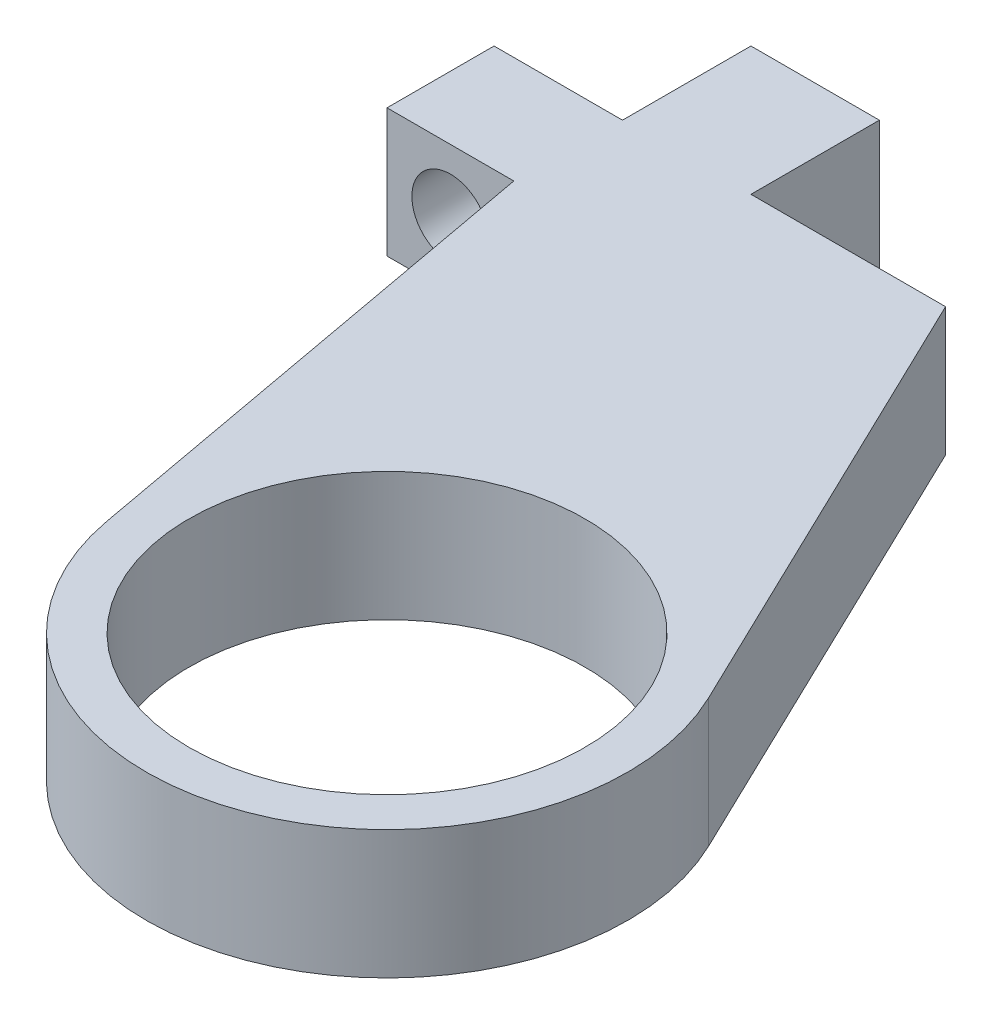
ISO-10303-21;
HEADER;
FILE_DESCRIPTION(('STEP AP214'),'2;1');
FILE_NAME('part.step','',(''),(''),'','','');
FILE_SCHEMA(('AUTOMOTIVE_DESIGN { 1 0 10303 214 1 1 1 1 }'));
ENDSEC;
DATA;
#1=APPLICATION_CONTEXT('core data for automotive mechanical design processes');
#2=APPLICATION_PROTOCOL_DEFINITION('international standard','automotive_design',2000,#1);
#3=PRODUCT_CONTEXT('',#1,'mechanical');
#4=PRODUCT('Part','Part','',(#3));
#5=PRODUCT_RELATED_PRODUCT_CATEGORY('part','',(#4));
#6=PRODUCT_DEFINITION_FORMATION('','',#4);
#7=PRODUCT_DEFINITION_CONTEXT('part definition',#1,'design');
#8=PRODUCT_DEFINITION('design','',#6,#7);
#9=PRODUCT_DEFINITION_SHAPE('','',#8);
#10=(LENGTH_UNIT() NAMED_UNIT(*) SI_UNIT(.MILLI.,.METRE.));
#11=(NAMED_UNIT(*) PLANE_ANGLE_UNIT() SI_UNIT($,.RADIAN.));
#12=(NAMED_UNIT(*) SI_UNIT($,.STERADIAN.) SOLID_ANGLE_UNIT());
#13=UNCERTAINTY_MEASURE_WITH_UNIT(LENGTH_MEASURE(1.E-05),#10,'distance_accuracy_value','');
#14=(GEOMETRIC_REPRESENTATION_CONTEXT(3) GLOBAL_UNCERTAINTY_ASSIGNED_CONTEXT((#13)) GLOBAL_UNIT_ASSIGNED_CONTEXT((#10,
#11,#12)) REPRESENTATION_CONTEXT('',''));
#15=CARTESIAN_POINT('',(0.,0.,0.));
#16=DIRECTION('',(0.,0.,1.));
#17=DIRECTION('',(1.,0.,0.));
#18=AXIS2_PLACEMENT_3D('',#15,#16,#17);
#19=CARTESIAN_POINT('',(0.,6.,0.));
#20=DIRECTION('',(0.,1.,0.));
#21=DIRECTION('',(0.,0.,1.));
#22=AXIS2_PLACEMENT_3D('',#19,#20,#21);
#23=PLANE('',#22);
#24=DIRECTION('',(0.,0.,1.));
#25=VECTOR('',#24,1.);
#26=CARTESIAN_POINT('',(-21.25,6.,-26.25));
#27=LINE('',#26,#25);
#28=CARTESIAN_POINT('',(-21.25,6.,-26.25));
#29=VERTEX_POINT('',#28);
#30=CARTESIAN_POINT('',(-21.25,6.,-21.25));
#31=VERTEX_POINT('',#30);
#32=EDGE_CURVE('E162',#29,#31,#27,.T.);
#33=ORIENTED_EDGE('',*,*,#32,.T.);
#34=DIRECTION('',(1.,0.,0.));
#35=VECTOR('',#34,1.);
#36=CARTESIAN_POINT('',(-21.25,6.,-21.25));
#37=LINE('',#36,#35);
#38=CARTESIAN_POINT('',(-15.3275514760327,6.,-21.25));
#39=VERTEX_POINT('',#38);
#40=EDGE_CURVE('E100',#31,#39,#37,.T.);
#41=ORIENTED_EDGE('',*,*,#40,.T.);
#42=DIRECTION('',(0.180091480212623,0.,0.983649865935449));
#43=VECTOR('',#42,1.);
#44=CARTESIAN_POINT('',(-15.3275514760327,6.,-21.25));
#45=LINE('',#44,#43);
#46=CARTESIAN_POINT('',(-11.0660609917738,6.,2.02602915239201));
#47=VERTEX_POINT('',#46);
#48=EDGE_CURVE('E184',#39,#47,#45,.T.);
#49=ORIENTED_EDGE('',*,*,#48,.T.);
#50=CARTESIAN_POINT('',(0.,6.,0.));
#51=DIRECTION('',(0.,1.,0.));
#52=DIRECTION('',(0.,0.,1.));
#53=AXIS2_PLACEMENT_3D('',#50,#51,#52);
#54=CIRCLE('',#53,11.25);
#55=CARTESIAN_POINT('',(10.1351639217093,6.,-4.88271976259967));
#56=VERTEX_POINT('',#55);
#57=EDGE_CURVE('E203',#47,#56,#54,.T.);
#58=ORIENTED_EDGE('',*,*,#57,.T.);
#59=DIRECTION('',(-0.434019534453304,0.,-0.900903459707497));
#60=VECTOR('',#59,1.);
#61=CARTESIAN_POINT('',(-0.158743734257236,6.,-26.25));
#62=LINE('',#61,#60);
#63=CARTESIAN_POINT('',(-0.158743734257236,6.,-26.25));
#64=VERTEX_POINT('',#63);
#65=EDGE_CURVE('E200',#56,#64,#62,.T.);
#66=ORIENTED_EDGE('',*,*,#65,.T.);
#67=DIRECTION('',(-1.,0.,0.));
#68=VECTOR('',#67,1.);
#69=CARTESIAN_POINT('',(-9.25000000000001,6.,-26.25));
#70=LINE('',#69,#68);
#71=CARTESIAN_POINT('',(-9.25000000000001,6.,-26.25));
#72=VERTEX_POINT('',#71);
#73=EDGE_CURVE('E202',#64,#72,#70,.T.);
#74=ORIENTED_EDGE('',*,*,#73,.T.);
#75=DIRECTION('',(0.,0.,-1.));
#76=VECTOR('',#75,1.);
#77=CARTESIAN_POINT('',(-9.25,6.,-32.25));
#78=LINE('',#77,#76);
#79=CARTESIAN_POINT('',(-9.25,6.,-32.25));
#80=VERTEX_POINT('',#79);
#81=EDGE_CURVE('E125',#72,#80,#78,.T.);
#82=ORIENTED_EDGE('',*,*,#81,.T.);
#83=DIRECTION('',(-1.,0.,0.));
#84=VECTOR('',#83,1.);
#85=CARTESIAN_POINT('',(-15.25,6.,-32.25));
#86=LINE('',#85,#84);
#87=CARTESIAN_POINT('',(-15.25,6.,-32.25));
#88=VERTEX_POINT('',#87);
#89=EDGE_CURVE('E119',#80,#88,#86,.T.);
#90=ORIENTED_EDGE('',*,*,#89,.T.);
#91=DIRECTION('',(0.,0.,1.));
#92=VECTOR('',#91,1.);
#93=CARTESIAN_POINT('',(-15.25,6.,-26.25));
#94=LINE('',#93,#92);
#95=CARTESIAN_POINT('',(-15.25,6.,-26.25));
#96=VERTEX_POINT('',#95);
#97=EDGE_CURVE('E123',#88,#96,#94,.T.);
#98=ORIENTED_EDGE('',*,*,#97,.T.);
#99=DIRECTION('',(-1.,0.,0.));
#100=VECTOR('',#99,1.);
#101=CARTESIAN_POINT('',(-21.25,6.,-26.25));
#102=LINE('',#101,#100);
#103=EDGE_CURVE('E51',#96,#29,#102,.T.);
#104=ORIENTED_EDGE('',*,*,#103,.T.);
#105=EDGE_LOOP('',(#33,#41,#49,#58,#66,#74,#82,#90,#98,#104));
#106=FACE_BOUND('',#105,.T.);
#107=CARTESIAN_POINT('',(0.,6.,0.));
#108=DIRECTION('',(0.,1.,0.));
#109=DIRECTION('',(0.,0.,1.));
#110=AXIS2_PLACEMENT_3D('',#107,#108,#109);
#111=CIRCLE('',#110,9.25);
#112=CARTESIAN_POINT('',(0.,6.,9.25));
#113=VERTEX_POINT('',#112);
#114=EDGE_CURVE('E147',#113,#113,#111,.T.);
#115=ORIENTED_EDGE('',*,*,#114,.F.);
#116=EDGE_LOOP('',(#115));
#117=FACE_BOUND('',#116,.T.);
#118=ADVANCED_FACE('F33',(#106,#117),#23,.T.);
#119=CARTESIAN_POINT('',(0.,0.,0.));
#120=DIRECTION('',(0.,1.,0.));
#121=DIRECTION('',(0.,0.,1.));
#122=AXIS2_PLACEMENT_3D('',#119,#120,#121);
#123=PLANE('',#122);
#124=DIRECTION('',(0.,0.,1.));
#125=VECTOR('',#124,1.);
#126=CARTESIAN_POINT('',(-21.25,0.,-26.25));
#127=LINE('',#126,#125);
#128=CARTESIAN_POINT('',(-21.25,0.,-26.25));
#129=VERTEX_POINT('',#128);
#130=CARTESIAN_POINT('',(-21.25,0.,-21.25));
#131=VERTEX_POINT('',#130);
#132=EDGE_CURVE('E143',#129,#131,#127,.T.);
#133=ORIENTED_EDGE('',*,*,#132,.F.);
#134=DIRECTION('',(-1.,0.,0.));
#135=VECTOR('',#134,1.);
#136=CARTESIAN_POINT('',(-21.25,0.,-26.25));
#137=LINE('',#136,#135);
#138=CARTESIAN_POINT('',(-15.25,0.,-26.25));
#139=VERTEX_POINT('',#138);
#140=EDGE_CURVE('E92',#139,#129,#137,.T.);
#141=ORIENTED_EDGE('',*,*,#140,.F.);
#142=DIRECTION('',(0.,0.,1.));
#143=VECTOR('',#142,1.);
#144=CARTESIAN_POINT('',(-15.25,0.,-26.25));
#145=LINE('',#144,#143);
#146=CARTESIAN_POINT('',(-15.25,0.,-32.25));
#147=VERTEX_POINT('',#146);
#148=EDGE_CURVE('E86',#147,#139,#145,.T.);
#149=ORIENTED_EDGE('',*,*,#148,.F.);
#150=DIRECTION('',(-1.,0.,0.));
#151=VECTOR('',#150,1.);
#152=CARTESIAN_POINT('',(-15.25,0.,-32.25));
#153=LINE('',#152,#151);
#154=CARTESIAN_POINT('',(-9.25,0.,-32.25));
#155=VERTEX_POINT('',#154);
#156=EDGE_CURVE('E133',#155,#147,#153,.T.);
#157=ORIENTED_EDGE('',*,*,#156,.F.);
#158=DIRECTION('',(0.,0.,-1.));
#159=VECTOR('',#158,1.);
#160=CARTESIAN_POINT('',(-9.25,0.,-32.25));
#161=LINE('',#160,#159);
#162=CARTESIAN_POINT('',(-9.25000000000001,0.,-26.25));
#163=VERTEX_POINT('',#162);
#164=EDGE_CURVE('E157',#163,#155,#161,.T.);
#165=ORIENTED_EDGE('',*,*,#164,.F.);
#166=DIRECTION('',(-1.,0.,0.));
#167=VECTOR('',#166,1.);
#168=CARTESIAN_POINT('',(-9.25000000000001,0.,-26.25));
#169=LINE('',#168,#167);
#170=CARTESIAN_POINT('',(-0.158743734257236,0.,-26.25));
#171=VERTEX_POINT('',#170);
#172=EDGE_CURVE('E155',#171,#163,#169,.T.);
#173=ORIENTED_EDGE('',*,*,#172,.F.);
#174=DIRECTION('',(-0.434019534453304,0.,-0.900903459707497));
#175=VECTOR('',#174,1.);
#176=CARTESIAN_POINT('',(-0.158743734257236,0.,-26.25));
#177=LINE('',#176,#175);
#178=CARTESIAN_POINT('',(10.1351639217093,0.,-4.88271976259967));
#179=VERTEX_POINT('',#178);
#180=EDGE_CURVE('E153',#179,#171,#177,.T.);
#181=ORIENTED_EDGE('',*,*,#180,.F.);
#182=CARTESIAN_POINT('',(0.,0.,0.));
#183=DIRECTION('',(0.,1.,0.));
#184=DIRECTION('',(0.,0.,1.));
#185=AXIS2_PLACEMENT_3D('',#182,#183,#184);
#186=CIRCLE('',#185,11.25);
#187=CARTESIAN_POINT('',(-11.0660609917738,0.,2.02602915239201));
#188=VERTEX_POINT('',#187);
#189=EDGE_CURVE('E151',#188,#179,#186,.T.);
#190=ORIENTED_EDGE('',*,*,#189,.F.);
#191=DIRECTION('',(0.180091480212623,0.,0.983649865935449));
#192=VECTOR('',#191,1.);
#193=CARTESIAN_POINT('',(-15.3275514760327,0.,-21.25));
#194=LINE('',#193,#192);
#195=CARTESIAN_POINT('',(-15.3275514760327,0.,-21.25));
#196=VERTEX_POINT('',#195);
#197=EDGE_CURVE('E149',#196,#188,#194,.T.);
#198=ORIENTED_EDGE('',*,*,#197,.F.);
#199=DIRECTION('',(1.,0.,0.));
#200=VECTOR('',#199,1.);
#201=CARTESIAN_POINT('',(-21.25,0.,-21.25));
#202=LINE('',#201,#200);
#203=EDGE_CURVE('E146',#131,#196,#202,.T.);
#204=ORIENTED_EDGE('',*,*,#203,.F.);
#205=EDGE_LOOP('',(#133,#141,#149,#157,#165,#173,#181,#190,#198,#204));
#206=FACE_BOUND('',#205,.T.);
#207=CARTESIAN_POINT('',(0.,0.,0.));
#208=DIRECTION('',(0.,1.,0.));
#209=DIRECTION('',(0.,0.,1.));
#210=AXIS2_PLACEMENT_3D('',#207,#208,#209);
#211=CIRCLE('',#210,9.25);
#212=CARTESIAN_POINT('',(0.,0.,9.25));
#213=VERTEX_POINT('',#212);
#214=EDGE_CURVE('E211',#213,#213,#211,.T.);
#215=ORIENTED_EDGE('',*,*,#214,.T.);
#216=EDGE_LOOP('',(#215));
#217=FACE_BOUND('',#216,.T.);
#218=ADVANCED_FACE('F188',(#206,#217),#123,.F.);
#219=CARTESIAN_POINT('',(-21.25,6.,-26.25));
#220=DIRECTION('',(1.,0.,0.));
#221=DIRECTION('',(0.,0.,-1.));
#222=AXIS2_PLACEMENT_3D('',#219,#220,#221);
#223=PLANE('',#222);
#224=ORIENTED_EDGE('',*,*,#132,.T.);
#225=DIRECTION('',(0.,-1.,0.));
#226=VECTOR('',#225,1.);
#227=CARTESIAN_POINT('',(-21.25,6.,-21.25));
#228=LINE('',#227,#226);
#229=EDGE_CURVE('E11',#31,#131,#228,.T.);
#230=ORIENTED_EDGE('',*,*,#229,.F.);
#231=ORIENTED_EDGE('',*,*,#32,.F.);
#232=DIRECTION('',(0.,-1.,0.));
#233=VECTOR('',#232,1.);
#234=CARTESIAN_POINT('',(-21.25,6.,-26.25));
#235=LINE('',#234,#233);
#236=EDGE_CURVE('E139',#29,#129,#235,.T.);
#237=ORIENTED_EDGE('',*,*,#236,.T.);
#238=EDGE_LOOP('',(#224,#230,#231,#237));
#239=FACE_BOUND('',#238,.T.);
#240=ADVANCED_FACE('F35',(#239),#223,.F.);
#241=CARTESIAN_POINT('',(-21.25,6.,-21.25));
#242=DIRECTION('',(0.,0.,-1.));
#243=DIRECTION('',(-1.,0.,0.));
#244=AXIS2_PLACEMENT_3D('',#241,#242,#243);
#245=PLANE('',#244);
#246=CARTESIAN_POINT('',(-18.2887757380163,3.,-21.25));
#247=DIRECTION('',(0.,0.,1.));
#248=DIRECTION('',(1.,0.,0.));
#249=AXIS2_PLACEMENT_3D('',#246,#247,#248);
#250=CIRCLE('',#249,1.8);
#251=CARTESIAN_POINT('',(-16.4887757380164,3.,-21.25));
#252=VERTEX_POINT('',#251);
#253=EDGE_CURVE('E216',#252,#252,#250,.T.);
#254=ORIENTED_EDGE('',*,*,#253,.F.);
#255=EDGE_LOOP('',(#254));
#256=FACE_BOUND('',#255,.T.);
#257=ORIENTED_EDGE('',*,*,#203,.T.);
#258=DIRECTION('',(0.,-1.,0.));
#259=VECTOR('',#258,1.);
#260=CARTESIAN_POINT('',(-15.3275514760327,6.,-21.25));
#261=LINE('',#260,#259);
#262=EDGE_CURVE('E43',#39,#196,#261,.T.);
#263=ORIENTED_EDGE('',*,*,#262,.F.);
#264=ORIENTED_EDGE('',*,*,#40,.F.);
#265=ORIENTED_EDGE('',*,*,#229,.T.);
#266=EDGE_LOOP('',(#257,#263,#264,#265));
#267=FACE_BOUND('',#266,.T.);
#268=ADVANCED_FACE('F260',(#256,#267),#245,.F.);
#269=CARTESIAN_POINT('',(-15.3275514760327,6.,-21.25));
#270=DIRECTION('',(0.983649865935449,0.,-0.180091480212623));
#271=DIRECTION('',(-0.180091480212623,0.,-0.983649865935449));
#272=AXIS2_PLACEMENT_3D('',#269,#270,#271);
#273=PLANE('',#272);
#274=ORIENTED_EDGE('',*,*,#197,.T.);
#275=DIRECTION('',(0.,-1.,0.));
#276=VECTOR('',#275,1.);
#277=CARTESIAN_POINT('',(-11.0660609917738,6.,2.02602915239201));
#278=LINE('',#277,#276);
#279=EDGE_CURVE('E175',#47,#188,#278,.T.);
#280=ORIENTED_EDGE('',*,*,#279,.F.);
#281=ORIENTED_EDGE('',*,*,#48,.F.);
#282=ORIENTED_EDGE('',*,*,#262,.T.);
#283=EDGE_LOOP('',(#274,#280,#281,#282));
#284=FACE_BOUND('',#283,.T.);
#285=ADVANCED_FACE('F182',(#284),#273,.F.);
#286=CARTESIAN_POINT('',(0.,6.,0.));
#287=DIRECTION('',(0.,-1.,0.));
#288=DIRECTION('',(0.,0.,-1.));
#289=AXIS2_PLACEMENT_3D('',#286,#287,#288);
#290=CYLINDRICAL_SURFACE('',#289,11.25);
#291=ORIENTED_EDGE('',*,*,#189,.T.);
#292=DIRECTION('',(0.,-1.,0.));
#293=VECTOR('',#292,1.);
#294=CARTESIAN_POINT('',(10.1351639217093,6.,-4.88271976259967));
#295=LINE('',#294,#293);
#296=EDGE_CURVE('E172',#56,#179,#295,.T.);
#297=ORIENTED_EDGE('',*,*,#296,.F.);
#298=ORIENTED_EDGE('',*,*,#57,.F.);
#299=ORIENTED_EDGE('',*,*,#279,.T.);
#300=EDGE_LOOP('',(#291,#297,#298,#299));
#301=FACE_BOUND('',#300,.T.);
#302=ADVANCED_FACE('F194',(#301),#290,.T.);
#303=CARTESIAN_POINT('',(-0.158743734257236,6.,-26.25));
#304=DIRECTION('',(-0.900903459707497,0.,0.434019534453304));
#305=DIRECTION('',(0.434019534453304,0.,0.900903459707497));
#306=AXIS2_PLACEMENT_3D('',#303,#304,#305);
#307=PLANE('',#306);
#308=ORIENTED_EDGE('',*,*,#180,.T.);
#309=DIRECTION('',(0.,-1.,0.));
#310=VECTOR('',#309,1.);
#311=CARTESIAN_POINT('',(-0.158743734257236,6.,-26.25));
#312=LINE('',#311,#310);
#313=EDGE_CURVE('E169',#64,#171,#312,.T.);
#314=ORIENTED_EDGE('',*,*,#313,.F.);
#315=ORIENTED_EDGE('',*,*,#65,.F.);
#316=ORIENTED_EDGE('',*,*,#296,.T.);
#317=EDGE_LOOP('',(#308,#314,#315,#316));
#318=FACE_BOUND('',#317,.T.);
#319=ADVANCED_FACE('F198',(#318),#307,.F.);
#320=CARTESIAN_POINT('',(-9.25000000000001,6.,-26.25));
#321=DIRECTION('',(0.,0.,1.));
#322=DIRECTION('',(1.,0.,0.));
#323=AXIS2_PLACEMENT_3D('',#320,#321,#322);
#324=PLANE('',#323);
#325=ORIENTED_EDGE('',*,*,#172,.T.);
#326=DIRECTION('',(0.,-1.,0.));
#327=VECTOR('',#326,1.);
#328=CARTESIAN_POINT('',(-9.25000000000001,6.,-26.25));
#329=LINE('',#328,#327);
#330=EDGE_CURVE('E166',#72,#163,#329,.T.);
#331=ORIENTED_EDGE('',*,*,#330,.F.);
#332=ORIENTED_EDGE('',*,*,#73,.F.);
#333=ORIENTED_EDGE('',*,*,#313,.T.);
#334=EDGE_LOOP('',(#325,#331,#332,#333));
#335=FACE_BOUND('',#334,.T.);
#336=ADVANCED_FACE('F250',(#335),#324,.F.);
#337=CARTESIAN_POINT('',(-9.25,6.,-32.25));
#338=DIRECTION('',(-1.,0.,0.));
#339=DIRECTION('',(0.,0.,1.));
#340=AXIS2_PLACEMENT_3D('',#337,#338,#339);
#341=PLANE('',#340);
#342=ORIENTED_EDGE('',*,*,#164,.T.);
#343=DIRECTION('',(0.,-1.,0.));
#344=VECTOR('',#343,1.);
#345=CARTESIAN_POINT('',(-9.25,6.,-32.25));
#346=LINE('',#345,#344);
#347=EDGE_CURVE('E134',#80,#155,#346,.T.);
#348=ORIENTED_EDGE('',*,*,#347,.F.);
#349=ORIENTED_EDGE('',*,*,#81,.F.);
#350=ORIENTED_EDGE('',*,*,#330,.T.);
#351=EDGE_LOOP('',(#342,#348,#349,#350));
#352=FACE_BOUND('',#351,.T.);
#353=ADVANCED_FACE('F247',(#352),#341,.F.);
#354=CARTESIAN_POINT('',(-15.25,6.,-32.25));
#355=DIRECTION('',(0.,0.,1.));
#356=DIRECTION('',(1.,0.,0.));
#357=AXIS2_PLACEMENT_3D('',#354,#355,#356);
#358=PLANE('',#357);
#359=ORIENTED_EDGE('',*,*,#156,.T.);
#360=DIRECTION('',(0.,-1.,0.));
#361=VECTOR('',#360,1.);
#362=CARTESIAN_POINT('',(-15.25,6.,-32.25));
#363=LINE('',#362,#361);
#364=EDGE_CURVE('E130',#88,#147,#363,.T.);
#365=ORIENTED_EDGE('',*,*,#364,.F.);
#366=ORIENTED_EDGE('',*,*,#89,.F.);
#367=ORIENTED_EDGE('',*,*,#347,.T.);
#368=EDGE_LOOP('',(#359,#365,#366,#367));
#369=FACE_BOUND('',#368,.T.);
#370=ADVANCED_FACE('F131',(#369),#358,.F.);
#371=CARTESIAN_POINT('',(-15.25,6.,-26.25));
#372=DIRECTION('',(1.,0.,0.));
#373=DIRECTION('',(0.,0.,-1.));
#374=AXIS2_PLACEMENT_3D('',#371,#372,#373);
#375=PLANE('',#374);
#376=ORIENTED_EDGE('',*,*,#148,.T.);
#377=DIRECTION('',(0.,-1.,0.));
#378=VECTOR('',#377,1.);
#379=CARTESIAN_POINT('',(-15.25,6.,-26.25));
#380=LINE('',#379,#378);
#381=EDGE_CURVE('E135',#96,#139,#380,.T.);
#382=ORIENTED_EDGE('',*,*,#381,.F.);
#383=ORIENTED_EDGE('',*,*,#97,.F.);
#384=ORIENTED_EDGE('',*,*,#364,.T.);
#385=EDGE_LOOP('',(#376,#382,#383,#384));
#386=FACE_BOUND('',#385,.T.);
#387=ADVANCED_FACE('F137',(#386),#375,.F.);
#388=CARTESIAN_POINT('',(-21.25,6.,-26.25));
#389=DIRECTION('',(0.,0.,1.));
#390=DIRECTION('',(1.,0.,0.));
#391=AXIS2_PLACEMENT_3D('',#388,#389,#390);
#392=PLANE('',#391);
#393=CARTESIAN_POINT('',(-18.2887757380163,3.,-26.25));
#394=DIRECTION('',(0.,0.,1.));
#395=DIRECTION('',(1.,0.,0.));
#396=AXIS2_PLACEMENT_3D('',#393,#394,#395);
#397=CIRCLE('',#396,1.8);
#398=CARTESIAN_POINT('',(-16.4887757380164,3.,-26.25));
#399=VERTEX_POINT('',#398);
#400=EDGE_CURVE('E37',#399,#399,#397,.T.);
#401=ORIENTED_EDGE('',*,*,#400,.T.);
#402=EDGE_LOOP('',(#401));
#403=FACE_BOUND('',#402,.T.);
#404=ORIENTED_EDGE('',*,*,#140,.T.);
#405=ORIENTED_EDGE('',*,*,#236,.F.);
#406=ORIENTED_EDGE('',*,*,#103,.F.);
#407=ORIENTED_EDGE('',*,*,#381,.T.);
#408=EDGE_LOOP('',(#404,#405,#406,#407));
#409=FACE_BOUND('',#408,.T.);
#410=ADVANCED_FACE('F223',(#403,#409),#392,.F.);
#411=CARTESIAN_POINT('',(0.,6.,0.));
#412=DIRECTION('',(0.,-1.,0.));
#413=DIRECTION('',(0.,0.,-1.));
#414=AXIS2_PLACEMENT_3D('',#411,#412,#413);
#415=CYLINDRICAL_SURFACE('',#414,9.25);
#416=ORIENTED_EDGE('',*,*,#114,.T.);
#417=EDGE_LOOP('',(#416));
#418=FACE_BOUND('',#417,.T.);
#419=ORIENTED_EDGE('',*,*,#214,.F.);
#420=EDGE_LOOP('',(#419));
#421=FACE_BOUND('',#420,.T.);
#422=ADVANCED_FACE('F227',(#418,#421),#415,.F.);
#423=CARTESIAN_POINT('',(-18.2887757380163,3.,-32.25));
#424=DIRECTION('',(0.,0.,1.));
#425=DIRECTION('',(1.,0.,0.));
#426=AXIS2_PLACEMENT_3D('',#423,#424,#425);
#427=CYLINDRICAL_SURFACE('',#426,1.8);
#428=ORIENTED_EDGE('',*,*,#253,.T.);
#429=EDGE_LOOP('',(#428));
#430=FACE_BOUND('',#429,.T.);
#431=ORIENTED_EDGE('',*,*,#400,.F.);
#432=EDGE_LOOP('',(#431));
#433=FACE_BOUND('',#432,.T.);
#434=ADVANCED_FACE('F225',(#430,#433),#427,.F.);
#435=CLOSED_SHELL('',(#118,#218,#240,#268,#285,#302,#319,#336,#353,#370,#387,#410,#422,#434));
#436=MANIFOLD_SOLID_BREP('B2',#435);
#437=ADVANCED_BREP_SHAPE_REPRESENTATION('',(#18,#436),#14);
#438=SHAPE_DEFINITION_REPRESENTATION(#9,#437);
ENDSEC;
END-ISO-10303-21;
